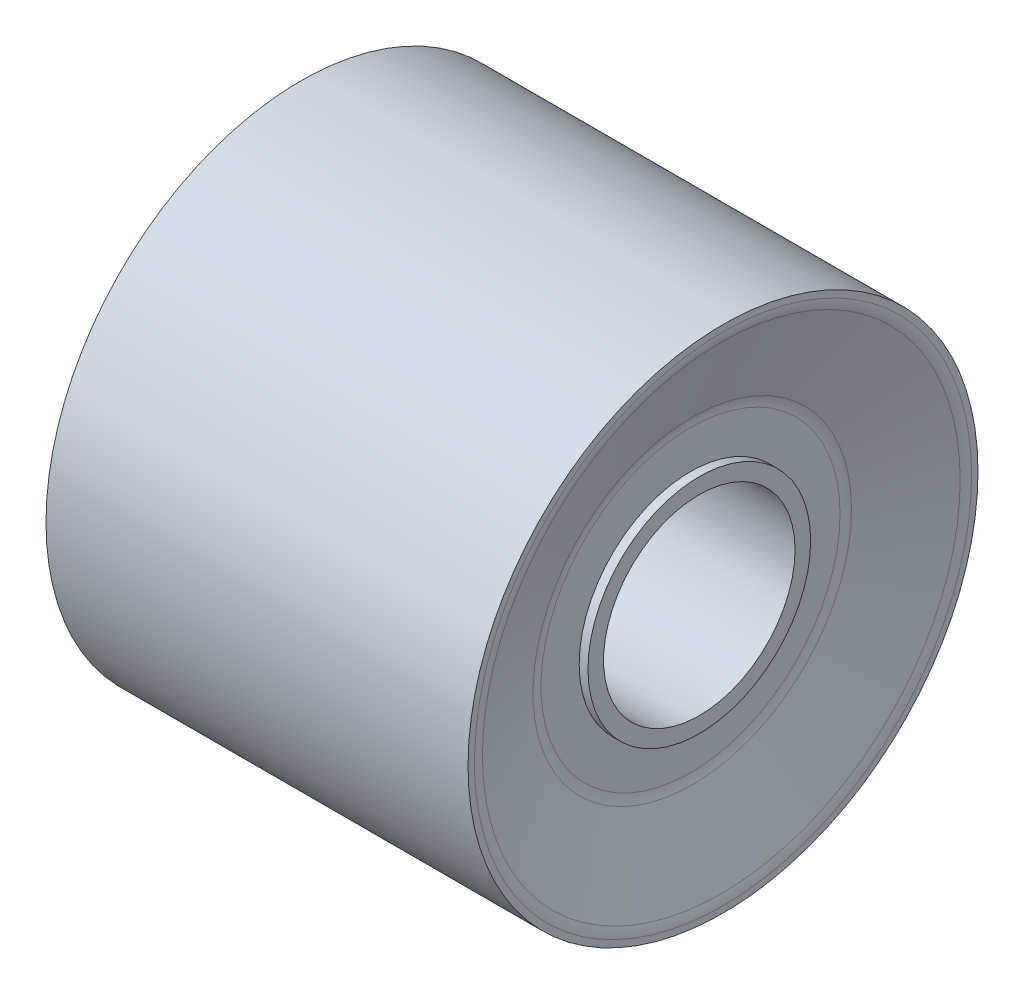
ISO-10303-21;
HEADER;
FILE_DESCRIPTION(('STEP AP214'),'2;1');
FILE_NAME('part.step','',(''),(''),'','','');
FILE_SCHEMA(('AUTOMOTIVE_DESIGN { 1 0 10303 214 1 1 1 1 }'));
ENDSEC;
DATA;
#1=APPLICATION_CONTEXT('core data for automotive mechanical design processes');
#2=APPLICATION_PROTOCOL_DEFINITION('international standard','automotive_design',2000,#1);
#3=PRODUCT_CONTEXT('',#1,'mechanical');
#4=PRODUCT('Part','Part','',(#3));
#5=PRODUCT_RELATED_PRODUCT_CATEGORY('part','',(#4));
#6=PRODUCT_DEFINITION_FORMATION('','',#4);
#7=PRODUCT_DEFINITION_CONTEXT('part definition',#1,'design');
#8=PRODUCT_DEFINITION('design','',#6,#7);
#9=PRODUCT_DEFINITION_SHAPE('','',#8);
#10=(LENGTH_UNIT() NAMED_UNIT(*) SI_UNIT(.MILLI.,.METRE.));
#11=(NAMED_UNIT(*) PLANE_ANGLE_UNIT() SI_UNIT($,.RADIAN.));
#12=(NAMED_UNIT(*) SI_UNIT($,.STERADIAN.) SOLID_ANGLE_UNIT());
#13=UNCERTAINTY_MEASURE_WITH_UNIT(LENGTH_MEASURE(1.E-05),#10,'distance_accuracy_value','');
#14=(GEOMETRIC_REPRESENTATION_CONTEXT(3) GLOBAL_UNCERTAINTY_ASSIGNED_CONTEXT((#13)) GLOBAL_UNIT_ASSIGNED_CONTEXT((#10,
#11,#12)) REPRESENTATION_CONTEXT('',''));
#15=CARTESIAN_POINT('',(0.,0.,0.));
#16=DIRECTION('',(0.,0.,1.));
#17=DIRECTION('',(1.,0.,0.));
#18=AXIS2_PLACEMENT_3D('',#15,#16,#17);
#19=CARTESIAN_POINT('',(76.3515513126491,0.,0.));
#20=DIRECTION('',(1.,0.,0.));
#21=DIRECTION('',(0.,0.,-1.));
#22=AXIS2_PLACEMENT_3D('',#19,#20,#21);
#23=CYLINDRICAL_SURFACE('',#22,18.0213341371204);
#24=CARTESIAN_POINT('',(-14.4122179930382,0.,0.));
#25=DIRECTION('',(1.,0.,0.));
#26=DIRECTION('',(0.,0.,-1.));
#27=AXIS2_PLACEMENT_3D('',#24,#25,#26);
#28=CIRCLE('',#27,18.0213341371204);
#29=CARTESIAN_POINT('',(-14.4122179930382,0.,-18.0213341371204));
#30=VERTEX_POINT('',#29);
#31=EDGE_CURVE('E70',#30,#30,#28,.T.);
#32=ORIENTED_EDGE('',*,*,#31,.T.);
#33=EDGE_LOOP('',(#32));
#34=FACE_BOUND('',#33,.T.);
#35=CARTESIAN_POINT('',(15.4167277826395,0.,0.));
#36=DIRECTION('',(1.,0.,0.));
#37=DIRECTION('',(0.,0.,-1.));
#38=AXIS2_PLACEMENT_3D('',#35,#36,#37);
#39=CIRCLE('',#38,18.0213341371204);
#40=CARTESIAN_POINT('',(15.4167277826395,0.,-18.0213341371204));
#41=VERTEX_POINT('',#40);
#42=EDGE_CURVE('E91',#41,#41,#39,.T.);
#43=ORIENTED_EDGE('',*,*,#42,.F.);
#44=EDGE_LOOP('',(#43));
#45=FACE_BOUND('',#44,.T.);
#46=ADVANCED_FACE('F38',(#34,#45),#23,.T.);
#47=CARTESIAN_POINT('',(-14.4122179930382,18.0213341371204,0.));
#48=DIRECTION('',(-1.,0.,0.));
#49=DIRECTION('',(0.,0.,1.));
#50=AXIS2_PLACEMENT_3D('',#47,#48,#49);
#51=PLANE('',#50);
#52=CARTESIAN_POINT('',(-14.4122179930382,0.,0.));
#53=DIRECTION('',(-1.,0.,0.));
#54=DIRECTION('',(0.,0.,1.));
#55=AXIS2_PLACEMENT_3D('',#52,#53,#54);
#56=CIRCLE('',#55,17.5857851032111);
#57=CARTESIAN_POINT('',(-14.4122179930382,0.,17.5857851032111));
#58=VERTEX_POINT('',#57);
#59=EDGE_CURVE('E53',#58,#58,#56,.F.);
#60=ORIENTED_EDGE('',*,*,#59,.T.);
#61=EDGE_LOOP('',(#60));
#62=FACE_BOUND('',#61,.T.);
#63=ORIENTED_EDGE('',*,*,#31,.F.);
#64=EDGE_LOOP('',(#63));
#65=FACE_BOUND('',#64,.T.);
#66=ADVANCED_FACE('F98',(#62,#65),#51,.T.);
#67=CARTESIAN_POINT('',(-14.4122179930382,0.,0.));
#68=DIRECTION('',(-1.,0.,0.));
#69=DIRECTION('',(0.,0.,1.));
#70=AXIS2_PLACEMENT_3D('',#67,#68,#69);
#71=CONICAL_SURFACE('',#70,17.2137771293001,1.20299161834207);
#72=CARTESIAN_POINT('',(-14.2784558924093,0.,0.));
#73=DIRECTION('',(1.,0.,0.));
#74=DIRECTION('',(0.,0.,-1.));
#75=AXIS2_PLACEMENT_3D('',#72,#73,#74);
#76=CIRCLE('',#75,16.8666494394096);
#77=CARTESIAN_POINT('',(-14.2784558924093,0.,-16.8666494394096));
#78=VERTEX_POINT('',#77);
#79=EDGE_CURVE('E45',#78,#78,#76,.F.);
#80=ORIENTED_EDGE('',*,*,#79,.T.);
#81=EDGE_LOOP('',(#80));
#82=FACE_BOUND('',#81,.T.);
#83=CARTESIAN_POINT('',(-12.1209536685639,0.,0.));
#84=DIRECTION('',(-1.,0.,0.));
#85=DIRECTION('',(0.,0.,1.));
#86=AXIS2_PLACEMENT_3D('',#83,#84,#85);
#87=CIRCLE('',#86,11.2676886024055);
#88=CARTESIAN_POINT('',(-12.1209536685639,0.,11.2676886024055));
#89=VERTEX_POINT('',#88);
#90=EDGE_CURVE('E49',#89,#89,#87,.F.);
#91=ORIENTED_EDGE('',*,*,#90,.T.);
#92=EDGE_LOOP('',(#91));
#93=FACE_BOUND('',#92,.T.);
#94=ADVANCED_FACE('F104',(#82,#93),#71,.F.);
#95=CARTESIAN_POINT('',(-11.9871915679349,10.920560912515,0.));
#96=DIRECTION('',(-1.,0.,0.));
#97=DIRECTION('',(0.,0.,1.));
#98=AXIS2_PLACEMENT_3D('',#95,#96,#97);
#99=PLANE('',#98);
#100=CARTESIAN_POINT('',(-11.9871915679349,0.,0.));
#101=DIRECTION('',(-1.,0.,0.));
#102=DIRECTION('',(0.,0.,1.));
#103=AXIS2_PLACEMENT_3D('',#100,#101,#102);
#104=CIRCLE('',#103,10.548552938604);
#105=CARTESIAN_POINT('',(-11.9871915679349,0.,10.548552938604));
#106=VERTEX_POINT('',#105);
#107=EDGE_CURVE('E10',#106,#106,#104,.T.);
#108=ORIENTED_EDGE('',*,*,#107,.T.);
#109=EDGE_LOOP('',(#108));
#110=FACE_BOUND('',#109,.T.);
#111=CARTESIAN_POINT('',(-11.9871915679349,0.,0.));
#112=DIRECTION('',(1.,0.,0.));
#113=DIRECTION('',(0.,0.,-1.));
#114=AXIS2_PLACEMENT_3D('',#111,#112,#113);
#115=CIRCLE('',#114,7.87006187193053);
#116=CARTESIAN_POINT('',(-11.9871915679349,0.,-7.87006187193053));
#117=VERTEX_POINT('',#116);
#118=EDGE_CURVE('E73',#117,#117,#115,.T.);
#119=ORIENTED_EDGE('',*,*,#118,.T.);
#120=EDGE_LOOP('',(#119));
#121=FACE_BOUND('',#120,.T.);
#122=ADVANCED_FACE('F133',(#110,#121),#99,.T.);
#123=CARTESIAN_POINT('',(76.3515513126491,0.,0.));
#124=DIRECTION('',(1.,0.,0.));
#125=DIRECTION('',(0.,0.,-1.));
#126=AXIS2_PLACEMENT_3D('',#123,#124,#125);
#127=CYLINDRICAL_SURFACE('',#126,7.87006187193053);
#128=CARTESIAN_POINT('',(-12.4532939150401,0.,0.));
#129=DIRECTION('',(1.,0.,0.));
#130=DIRECTION('',(0.,0.,-1.));
#131=AXIS2_PLACEMENT_3D('',#128,#129,#130);
#132=CIRCLE('',#131,7.87006187193053);
#133=CARTESIAN_POINT('',(-12.4532939150401,0.,-7.87006187193053));
#134=VERTEX_POINT('',#133);
#135=EDGE_CURVE('E76',#134,#134,#132,.T.);
#136=ORIENTED_EDGE('',*,*,#135,.T.);
#137=EDGE_LOOP('',(#136));
#138=FACE_BOUND('',#137,.T.);
#139=ORIENTED_EDGE('',*,*,#118,.F.);
#140=EDGE_LOOP('',(#139));
#141=FACE_BOUND('',#140,.T.);
#142=ADVANCED_FACE('F137',(#138,#141),#127,.T.);
#143=CARTESIAN_POINT('',(-12.4532939150401,7.87006187193053,0.));
#144=DIRECTION('',(-1.,0.,0.));
#145=DIRECTION('',(0.,0.,1.));
#146=AXIS2_PLACEMENT_3D('',#143,#144,#145);
#147=PLANE('',#146);
#148=CARTESIAN_POINT('',(-12.4532939150401,0.,0.));
#149=DIRECTION('',(1.,0.,0.));
#150=DIRECTION('',(0.,0.,-1.));
#151=AXIS2_PLACEMENT_3D('',#148,#149,#150);
#152=CIRCLE('',#151,6.76670542884114);
#153=CARTESIAN_POINT('',(-12.4532939150401,0.,-6.76670542884114));
#154=VERTEX_POINT('',#153);
#155=EDGE_CURVE('E79',#154,#154,#152,.T.);
#156=ORIENTED_EDGE('',*,*,#155,.T.);
#157=EDGE_LOOP('',(#156));
#158=FACE_BOUND('',#157,.T.);
#159=ORIENTED_EDGE('',*,*,#135,.F.);
#160=EDGE_LOOP('',(#159));
#161=FACE_BOUND('',#160,.T.);
#162=ADVANCED_FACE('F142',(#158,#161),#147,.T.);
#163=CARTESIAN_POINT('',(76.3515513126491,0.,0.));
#164=DIRECTION('',(1.,0.,0.));
#165=DIRECTION('',(0.,0.,-1.));
#166=AXIS2_PLACEMENT_3D('',#163,#164,#165);
#167=CYLINDRICAL_SURFACE('',#166,6.76670542884114);
#168=CARTESIAN_POINT('',(13.7401744795971,0.,0.));
#169=DIRECTION('',(1.,0.,0.));
#170=DIRECTION('',(0.,0.,-1.));
#171=AXIS2_PLACEMENT_3D('',#168,#169,#170);
#172=CIRCLE('',#171,6.76670542884114);
#173=CARTESIAN_POINT('',(13.7401744795971,0.,-6.76670542884114));
#174=VERTEX_POINT('',#173);
#175=EDGE_CURVE('E82',#174,#174,#172,.T.);
#176=ORIENTED_EDGE('',*,*,#175,.T.);
#177=EDGE_LOOP('',(#176));
#178=FACE_BOUND('',#177,.T.);
#179=ORIENTED_EDGE('',*,*,#155,.F.);
#180=EDGE_LOOP('',(#179));
#181=FACE_BOUND('',#180,.T.);
#182=ADVANCED_FACE('F146',(#178,#181),#167,.F.);
#183=CARTESIAN_POINT('',(13.7401744795971,7.87006187193053,0.));
#184=DIRECTION('',(1.,0.,0.));
#185=DIRECTION('',(0.,0.,-1.));
#186=AXIS2_PLACEMENT_3D('',#183,#184,#185);
#187=PLANE('',#186);
#188=CARTESIAN_POINT('',(13.7401744795971,0.,0.));
#189=DIRECTION('',(1.,0.,0.));
#190=DIRECTION('',(0.,0.,-1.));
#191=AXIS2_PLACEMENT_3D('',#188,#189,#190);
#192=CIRCLE('',#191,7.87006187193053);
#193=CARTESIAN_POINT('',(13.7401744795971,0.,-7.87006187193053));
#194=VERTEX_POINT('',#193);
#195=EDGE_CURVE('E85',#194,#194,#192,.T.);
#196=ORIENTED_EDGE('',*,*,#195,.T.);
#197=EDGE_LOOP('',(#196));
#198=FACE_BOUND('',#197,.T.);
#199=ORIENTED_EDGE('',*,*,#175,.F.);
#200=EDGE_LOOP('',(#199));
#201=FACE_BOUND('',#200,.T.);
#202=ADVANCED_FACE('F150',(#198,#201),#187,.T.);
#203=CARTESIAN_POINT('',(76.3515513126491,0.,0.));
#204=DIRECTION('',(1.,0.,0.));
#205=DIRECTION('',(0.,0.,-1.));
#206=AXIS2_PLACEMENT_3D('',#203,#204,#205);
#207=CYLINDRICAL_SURFACE('',#206,7.87006187193053);
#208=CARTESIAN_POINT('',(13.1201122035124,0.,0.));
#209=DIRECTION('',(1.,0.,0.));
#210=DIRECTION('',(0.,0.,-1.));
#211=AXIS2_PLACEMENT_3D('',#208,#209,#210);
#212=CIRCLE('',#211,7.87006187193053);
#213=CARTESIAN_POINT('',(13.1201122035124,0.,-7.87006187193053));
#214=VERTEX_POINT('',#213);
#215=EDGE_CURVE('E88',#214,#214,#212,.T.);
#216=ORIENTED_EDGE('',*,*,#215,.T.);
#217=EDGE_LOOP('',(#216));
#218=FACE_BOUND('',#217,.T.);
#219=ORIENTED_EDGE('',*,*,#195,.F.);
#220=EDGE_LOOP('',(#219));
#221=FACE_BOUND('',#220,.T.);
#222=ADVANCED_FACE('F154',(#218,#221),#207,.T.);
#223=CARTESIAN_POINT('',(13.1201122035125,10.920560912515,0.));
#224=DIRECTION('',(1.,0.,0.));
#225=DIRECTION('',(0.,0.,-1.));
#226=AXIS2_PLACEMENT_3D('',#223,#224,#225);
#227=PLANE('',#226);
#228=CARTESIAN_POINT('',(13.1201122035125,0.,0.));
#229=DIRECTION('',(1.,0.,0.));
#230=DIRECTION('',(0.,0.,-1.));
#231=AXIS2_PLACEMENT_3D('',#228,#229,#230);
#232=CIRCLE('',#231,10.5670286571419);
#233=CARTESIAN_POINT('',(13.1201122035125,0.,-10.5670286571419));
#234=VERTEX_POINT('',#233);
#235=EDGE_CURVE('E58',#234,#234,#232,.T.);
#236=ORIENTED_EDGE('',*,*,#235,.T.);
#237=EDGE_LOOP('',(#236));
#238=FACE_BOUND('',#237,.T.);
#239=ORIENTED_EDGE('',*,*,#215,.F.);
#240=EDGE_LOOP('',(#239));
#241=FACE_BOUND('',#240,.T.);
#242=ADVANCED_FACE('F158',(#238,#241),#227,.T.);
#243=CARTESIAN_POINT('',(13.1201122035124,0.,0.));
#244=DIRECTION('',(1.,0.,0.));
#245=DIRECTION('',(0.,0.,-1.));
#246=AXIS2_PLACEMENT_3D('',#243,#244,#245);
#247=CONICAL_SURFACE('',#246,10.920560912515,1.22087873025954);
#248=CARTESIAN_POINT('',(15.2955297138903,0.,0.));
#249=DIRECTION('',(-1.,0.,0.));
#250=DIRECTION('',(0.,0.,1.));
#251=AXIS2_PLACEMENT_3D('',#248,#249,#250);
#252=CIRCLE('',#251,16.8816685872228);
#253=CARTESIAN_POINT('',(15.2955297138903,0.,16.8816685872228));
#254=VERTEX_POINT('',#253);
#255=EDGE_CURVE('E64',#254,#254,#252,.F.);
#256=ORIENTED_EDGE('',*,*,#255,.T.);
#257=EDGE_LOOP('',(#256));
#258=FACE_BOUND('',#257,.T.);
#259=CARTESIAN_POINT('',(13.2413102722617,0.,0.));
#260=DIRECTION('',(1.,0.,0.));
#261=DIRECTION('',(0.,0.,-1.));
#262=AXIS2_PLACEMENT_3D('',#259,#260,#261);
#263=CIRCLE('',#262,11.2526694545923);
#264=CARTESIAN_POINT('',(13.2413102722617,0.,-11.2526694545923));
#265=VERTEX_POINT('',#264);
#266=EDGE_CURVE('E67',#265,#265,#263,.F.);
#267=ORIENTED_EDGE('',*,*,#266,.T.);
#268=EDGE_LOOP('',(#267));
#269=FACE_BOUND('',#268,.T.);
#270=ADVANCED_FACE('F162',(#258,#269),#247,.F.);
#271=CARTESIAN_POINT('',(15.4167277826395,17.2137771293001,0.));
#272=DIRECTION('',(1.,0.,0.));
#273=DIRECTION('',(0.,0.,-1.));
#274=AXIS2_PLACEMENT_3D('',#271,#272,#273);
#275=PLANE('',#274);
#276=CARTESIAN_POINT('',(15.4167277826395,0.,0.));
#277=DIRECTION('',(1.,0.,0.));
#278=DIRECTION('',(0.,0.,-1.));
#279=AXIS2_PLACEMENT_3D('',#276,#277,#278);
#280=CIRCLE('',#279,17.5673093846733);
#281=CARTESIAN_POINT('',(15.4167277826395,0.,-17.5673093846733));
#282=VERTEX_POINT('',#281);
#283=EDGE_CURVE('E61',#282,#282,#280,.F.);
#284=ORIENTED_EDGE('',*,*,#283,.T.);
#285=EDGE_LOOP('',(#284));
#286=FACE_BOUND('',#285,.T.);
#287=ORIENTED_EDGE('',*,*,#42,.T.);
#288=EDGE_LOOP('',(#287));
#289=FACE_BOUND('',#288,.T.);
#290=ADVANCED_FACE('F95',(#286,#289),#275,.T.);
#291=CARTESIAN_POINT('',(13.4167277826395,0.,0.));
#292=DIRECTION('',(1.,0.,0.));
#293=DIRECTION('',(0.,0.,-1.));
#294=AXIS2_PLACEMENT_3D('',#291,#292,#293);
#295=TOROIDAL_SURFACE('',#294,17.5673093846733,2.);
#296=ORIENTED_EDGE('',*,*,#283,.F.);
#297=EDGE_LOOP('',(#296));
#298=FACE_BOUND('',#297,.T.);
#299=ORIENTED_EDGE('',*,*,#255,.F.);
#300=EDGE_LOOP('',(#299));
#301=FACE_BOUND('',#300,.T.);
#302=ADVANCED_FACE('F109',(#298,#301),#295,.T.);
#303=CARTESIAN_POINT('',(15.1201122035125,0.,0.));
#304=DIRECTION('',(1.,0.,0.));
#305=DIRECTION('',(0.,0.,-1.));
#306=AXIS2_PLACEMENT_3D('',#303,#304,#305);
#307=TOROIDAL_SURFACE('',#306,10.5670286571419,2.);
#308=ORIENTED_EDGE('',*,*,#266,.F.);
#309=EDGE_LOOP('',(#308));
#310=FACE_BOUND('',#309,.T.);
#311=ORIENTED_EDGE('',*,*,#235,.F.);
#312=EDGE_LOOP('',(#311));
#313=FACE_BOUND('',#312,.T.);
#314=ADVANCED_FACE('F112',(#310,#313),#307,.F.);
#315=CARTESIAN_POINT('',(-12.4122179930382,0.,0.));
#316=DIRECTION('',(-1.,0.,0.));
#317=DIRECTION('',(0.,0.,1.));
#318=AXIS2_PLACEMENT_3D('',#315,#316,#317);
#319=TOROIDAL_SURFACE('',#318,17.5857851032111,2.);
#320=ORIENTED_EDGE('',*,*,#79,.F.);
#321=EDGE_LOOP('',(#320));
#322=FACE_BOUND('',#321,.T.);
#323=ORIENTED_EDGE('',*,*,#59,.F.);
#324=EDGE_LOOP('',(#323));
#325=FACE_BOUND('',#324,.T.);
#326=ADVANCED_FACE('F115',(#322,#325),#319,.T.);
#327=CARTESIAN_POINT('',(-13.9871915679349,0.,0.));
#328=DIRECTION('',(-1.,0.,0.));
#329=DIRECTION('',(0.,0.,1.));
#330=AXIS2_PLACEMENT_3D('',#327,#328,#329);
#331=TOROIDAL_SURFACE('',#330,10.548552938604,2.);
#332=ORIENTED_EDGE('',*,*,#107,.F.);
#333=EDGE_LOOP('',(#332));
#334=FACE_BOUND('',#333,.T.);
#335=ORIENTED_EDGE('',*,*,#90,.F.);
#336=EDGE_LOOP('',(#335));
#337=FACE_BOUND('',#336,.T.);
#338=ADVANCED_FACE('F40',(#334,#337),#331,.F.);
#339=CLOSED_SHELL('',(#46,#66,#94,#122,#142,#162,#182,#202,#222,#242,#270,#290,#302,#314,#326,#338));
#340=MANIFOLD_SOLID_BREP('B2',#339);
#341=ADVANCED_BREP_SHAPE_REPRESENTATION('',(#18,#340),#14);
#342=SHAPE_DEFINITION_REPRESENTATION(#9,#341);
ENDSEC;
END-ISO-10303-21;
